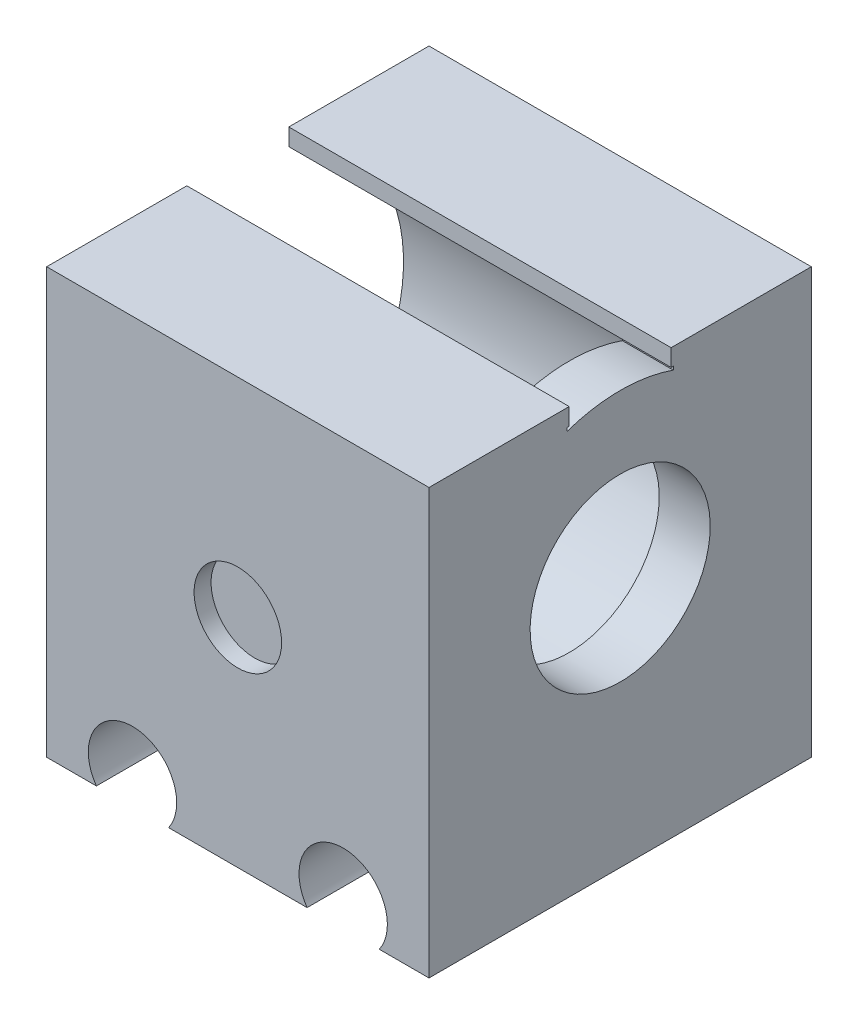
ISO-10303-21;
HEADER;
FILE_DESCRIPTION(('STEP AP214'),'2;1');
FILE_NAME('part.step','',(''),(''),'','','');
FILE_SCHEMA(('AUTOMOTIVE_DESIGN { 1 0 10303 214 1 1 1 1 }'));
ENDSEC;
DATA;
#1=APPLICATION_CONTEXT('core data for automotive mechanical design processes');
#2=APPLICATION_PROTOCOL_DEFINITION('international standard','automotive_design',2000,#1);
#3=PRODUCT_CONTEXT('',#1,'mechanical');
#4=PRODUCT('Part','Part','',(#3));
#5=PRODUCT_RELATED_PRODUCT_CATEGORY('part','',(#4));
#6=PRODUCT_DEFINITION_FORMATION('','',#4);
#7=PRODUCT_DEFINITION_CONTEXT('part definition',#1,'design');
#8=PRODUCT_DEFINITION('design','',#6,#7);
#9=PRODUCT_DEFINITION_SHAPE('','',#8);
#10=(LENGTH_UNIT() NAMED_UNIT(*) SI_UNIT(.MILLI.,.METRE.));
#11=(NAMED_UNIT(*) PLANE_ANGLE_UNIT() SI_UNIT($,.RADIAN.));
#12=(NAMED_UNIT(*) SI_UNIT($,.STERADIAN.) SOLID_ANGLE_UNIT());
#13=UNCERTAINTY_MEASURE_WITH_UNIT(LENGTH_MEASURE(1.E-05),#10,'distance_accuracy_value','');
#14=(GEOMETRIC_REPRESENTATION_CONTEXT(3) GLOBAL_UNCERTAINTY_ASSIGNED_CONTEXT((#13)) GLOBAL_UNIT_ASSIGNED_CONTEXT((#10,
#11,#12)) REPRESENTATION_CONTEXT('',''));
#15=CARTESIAN_POINT('',(0.,0.,0.));
#16=DIRECTION('',(0.,0.,1.));
#17=DIRECTION('',(1.,0.,0.));
#18=AXIS2_PLACEMENT_3D('',#15,#16,#17);
#19=CARTESIAN_POINT('',(-14.2633928571429,22.0982142857143,45.));
#20=DIRECTION('',(0.,-1.,0.));
#21=DIRECTION('',(0.,0.,-1.));
#22=AXIS2_PLACEMENT_3D('',#19,#20,#21);
#23=PLANE('',#22);
#24=DIRECTION('',(0.,0.,-1.));
#25=VECTOR('',#24,1.);
#26=CARTESIAN_POINT('',(30.7366071428571,22.0982142857143,45.));
#27=LINE('',#26,#25);
#28=CARTESIAN_POINT('',(30.7366071428571,22.0982142857143,45.));
#29=VERTEX_POINT('',#28);
#30=CARTESIAN_POINT('',(30.7366071428572,22.0982142857143,28.5));
#31=VERTEX_POINT('',#30);
#32=EDGE_CURVE('E287',#29,#31,#27,.T.);
#33=ORIENTED_EDGE('',*,*,#32,.T.);
#34=DIRECTION('',(-1.,0.,0.));
#35=VECTOR('',#34,1.);
#36=CARTESIAN_POINT('',(30.7366071428572,22.0982142857143,28.5));
#37=LINE('',#36,#35);
#38=CARTESIAN_POINT('',(-14.2633928571429,22.0982142857143,28.5));
#39=VERTEX_POINT('',#38);
#40=EDGE_CURVE('E176',#31,#39,#37,.T.);
#41=ORIENTED_EDGE('',*,*,#40,.T.);
#42=DIRECTION('',(0.,0.,-1.));
#43=VECTOR('',#42,1.);
#44=CARTESIAN_POINT('',(-14.2633928571429,22.0982142857143,45.));
#45=LINE('',#44,#43);
#46=CARTESIAN_POINT('',(-14.2633928571429,22.0982142857143,45.));
#47=VERTEX_POINT('',#46);
#48=EDGE_CURVE('E189',#47,#39,#45,.T.);
#49=ORIENTED_EDGE('',*,*,#48,.F.);
#50=DIRECTION('',(-1.,0.,0.));
#51=VECTOR('',#50,1.);
#52=CARTESIAN_POINT('',(-14.2633928571429,22.0982142857143,45.));
#53=LINE('',#52,#51);
#54=EDGE_CURVE('E270',#29,#47,#53,.T.);
#55=ORIENTED_EDGE('',*,*,#54,.F.);
#56=EDGE_LOOP('',(#33,#41,#49,#55));
#57=FACE_BOUND('',#56,.T.);
#58=ADVANCED_FACE('F44',(#57),#23,.F.);
#59=CARTESIAN_POINT('',(-14.2633928571429,-27.9017857142857,45.));
#60=DIRECTION('',(0.,1.,0.));
#61=DIRECTION('',(0.,0.,1.));
#62=AXIS2_PLACEMENT_3D('',#59,#60,#61);
#63=PLANE('',#62);
#64=DIRECTION('',(1.,0.,0.));
#65=VECTOR('',#64,1.);
#66=CARTESIAN_POINT('',(-14.2633928571429,-27.9017857142857,0.));
#67=LINE('',#66,#65);
#68=CARTESIAN_POINT('',(-14.2633928571429,-27.9017857142857,0.));
#69=VERTEX_POINT('',#68);
#70=CARTESIAN_POINT('',(-8.41074497346191,-27.9017857142857,0.));
#71=VERTEX_POINT('',#70);
#72=EDGE_CURVE('E276',#69,#71,#67,.T.);
#73=ORIENTED_EDGE('',*,*,#72,.T.);
#74=DIRECTION('',(0.,0.,1.));
#75=VECTOR('',#74,1.);
#76=CARTESIAN_POINT('',(-8.41074497346191,-27.9017857142857,0.));
#77=LINE('',#76,#75);
#78=CARTESIAN_POINT('',(-8.41074497346191,-27.9017857142857,45.));
#79=VERTEX_POINT('',#78);
#80=EDGE_CURVE('E255',#71,#79,#77,.T.);
#81=ORIENTED_EDGE('',*,*,#80,.T.);
#82=DIRECTION('',(1.,0.,0.));
#83=VECTOR('',#82,1.);
#84=CARTESIAN_POINT('',(-14.2633928571429,-27.9017857142857,45.));
#85=LINE('',#84,#83);
#86=CARTESIAN_POINT('',(-14.2633928571429,-27.9017857142857,45.));
#87=VERTEX_POINT('',#86);
#88=EDGE_CURVE('E264',#87,#79,#85,.T.);
#89=ORIENTED_EDGE('',*,*,#88,.F.);
#90=DIRECTION('',(0.,0.,-1.));
#91=VECTOR('',#90,1.);
#92=CARTESIAN_POINT('',(-14.2633928571429,-27.9017857142857,45.));
#93=LINE('',#92,#91);
#94=EDGE_CURVE('E292',#87,#69,#93,.T.);
#95=ORIENTED_EDGE('',*,*,#94,.T.);
#96=EDGE_LOOP('',(#73,#81,#89,#95));
#97=FACE_BOUND('',#96,.T.);
#98=ADVANCED_FACE('F382',(#97),#63,.F.);
#99=CARTESIAN_POINT('',(0.0839592591762011,-27.9017857142857,45.));
#100=VERTEX_POINT('',#99);
#101=CARTESIAN_POINT('',(16.3892550265381,-27.9017857142857,45.));
#102=VERTEX_POINT('',#101);
#103=EDGE_CURVE('E268',#100,#102,#85,.T.);
#104=ORIENTED_EDGE('',*,*,#103,.F.);
#105=DIRECTION('',(0.,0.,1.));
#106=VECTOR('',#105,1.);
#107=CARTESIAN_POINT('',(0.0839592591762002,-27.9017857142857,0.));
#108=LINE('',#107,#106);
#109=CARTESIAN_POINT('',(0.0839592591762011,-27.9017857142857,0.));
#110=VERTEX_POINT('',#109);
#111=EDGE_CURVE('E252',#100,#110,#108,.F.);
#112=ORIENTED_EDGE('',*,*,#111,.T.);
#113=CARTESIAN_POINT('',(16.3892550265381,-27.9017857142857,0.));
#114=VERTEX_POINT('',#113);
#115=EDGE_CURVE('E280',#110,#114,#67,.T.);
#116=ORIENTED_EDGE('',*,*,#115,.T.);
#117=DIRECTION('',(0.,0.,1.));
#118=VECTOR('',#117,1.);
#119=CARTESIAN_POINT('',(16.3892550265381,-27.9017857142857,0.));
#120=LINE('',#119,#118);
#121=EDGE_CURVE('E249',#114,#102,#120,.T.);
#122=ORIENTED_EDGE('',*,*,#121,.T.);
#123=EDGE_LOOP('',(#104,#112,#116,#122));
#124=FACE_BOUND('',#123,.T.);
#125=ADVANCED_FACE('F390',(#124),#63,.F.);
#126=CARTESIAN_POINT('',(-14.2633928571429,22.0982142857143,45.));
#127=DIRECTION('',(1.,0.,0.));
#128=DIRECTION('',(0.,1.,0.));
#129=AXIS2_PLACEMENT_3D('',#126,#127,#128);
#130=PLANE('',#129);
#131=ORIENTED_EDGE('',*,*,#48,.T.);
#132=DIRECTION('',(0.,-1.,0.));
#133=VECTOR('',#132,1.);
#134=CARTESIAN_POINT('',(-14.2633928571429,22.0982142857143,28.5));
#135=LINE('',#134,#133);
#136=CARTESIAN_POINT('',(-14.2633928571429,20.0844199696068,28.5));
#137=VERTEX_POINT('',#136);
#138=EDGE_CURVE('E170',#39,#137,#135,.T.);
#139=ORIENTED_EDGE('',*,*,#138,.T.);
#140=DIRECTION('',(0.,0.,1.));
#141=VECTOR('',#140,1.);
#142=CARTESIAN_POINT('',(-14.2633928571429,20.0844199696068,28.5));
#143=LINE('',#142,#141);
#144=CARTESIAN_POINT('',(-14.2633928571429,20.0844199696068,28.75));
#145=VERTEX_POINT('',#144);
#146=EDGE_CURVE('E180',#137,#145,#143,.T.);
#147=ORIENTED_EDGE('',*,*,#146,.T.);
#148=CARTESIAN_POINT('',(-14.2633928571429,1.61315850754096,22.5));
#149=DIRECTION('',(-1.,0.,0.));
#150=DIRECTION('',(0.,-1.,0.));
#151=AXIS2_PLACEMENT_3D('',#148,#149,#150);
#152=CIRCLE('',#151,19.5);
#153=CARTESIAN_POINT('',(-14.2633928571429,20.0844199696068,16.25));
#154=VERTEX_POINT('',#153);
#155=EDGE_CURVE('E211',#154,#145,#152,.T.);
#156=ORIENTED_EDGE('',*,*,#155,.F.);
#157=DIRECTION('',(0.,0.,1.));
#158=VECTOR('',#157,1.);
#159=CARTESIAN_POINT('',(-14.2633928571429,20.0844199696068,16.25));
#160=LINE('',#159,#158);
#161=CARTESIAN_POINT('',(-14.2633928571429,20.0844199696068,16.5));
#162=VERTEX_POINT('',#161);
#163=EDGE_CURVE('E201',#154,#162,#160,.T.);
#164=ORIENTED_EDGE('',*,*,#163,.T.);
#165=DIRECTION('',(0.,1.,0.));
#166=VECTOR('',#165,1.);
#167=CARTESIAN_POINT('',(-14.2633928571429,20.0844199696068,16.5));
#168=LINE('',#167,#166);
#169=CARTESIAN_POINT('',(-14.2633928571429,22.0982142857143,16.5));
#170=VERTEX_POINT('',#169);
#171=EDGE_CURVE('E185',#162,#170,#168,.T.);
#172=ORIENTED_EDGE('',*,*,#171,.T.);
#173=CARTESIAN_POINT('',(-14.2633928571429,22.0982142857143,0.));
#174=VERTEX_POINT('',#173);
#175=EDGE_CURVE('E272',#170,#174,#45,.T.);
#176=ORIENTED_EDGE('',*,*,#175,.T.);
#177=DIRECTION('',(0.,-1.,0.));
#178=VECTOR('',#177,1.);
#179=CARTESIAN_POINT('',(-14.2633928571429,22.0982142857143,0.));
#180=LINE('',#179,#178);
#181=EDGE_CURVE('E258',#174,#69,#180,.T.);
#182=ORIENTED_EDGE('',*,*,#181,.T.);
#183=ORIENTED_EDGE('',*,*,#94,.F.);
#184=DIRECTION('',(0.,-1.,0.));
#185=VECTOR('',#184,1.);
#186=CARTESIAN_POINT('',(-14.2633928571429,22.0982142857143,45.));
#187=LINE('',#186,#185);
#188=EDGE_CURVE('E259',#47,#87,#187,.T.);
#189=ORIENTED_EDGE('',*,*,#188,.F.);
#190=EDGE_LOOP('',(#131,#139,#147,#156,#164,#172,#176,#182,#183,#189));
#191=FACE_BOUND('',#190,.T.);
#192=ADVANCED_FACE('F46',(#191),#130,.F.);
#193=CARTESIAN_POINT('',(24.8839592591762,-27.9017857142857,45.));
#194=VERTEX_POINT('',#193);
#195=CARTESIAN_POINT('',(30.7366071428571,-27.9017857142857,45.));
#196=VERTEX_POINT('',#195);
#197=EDGE_CURVE('E262',#194,#196,#85,.T.);
#198=ORIENTED_EDGE('',*,*,#197,.F.);
#199=DIRECTION('',(0.,0.,1.));
#200=VECTOR('',#199,1.);
#201=CARTESIAN_POINT('',(24.8839592591762,-27.9017857142857,0.));
#202=LINE('',#201,#200);
#203=CARTESIAN_POINT('',(24.8839592591762,-27.9017857142857,0.));
#204=VERTEX_POINT('',#203);
#205=EDGE_CURVE('E245',#194,#204,#202,.F.);
#206=ORIENTED_EDGE('',*,*,#205,.T.);
#207=CARTESIAN_POINT('',(30.7366071428571,-27.9017857142857,0.));
#208=VERTEX_POINT('',#207);
#209=EDGE_CURVE('E275',#204,#208,#67,.T.);
#210=ORIENTED_EDGE('',*,*,#209,.T.);
#211=DIRECTION('',(0.,0.,-1.));
#212=VECTOR('',#211,1.);
#213=CARTESIAN_POINT('',(30.7366071428571,-27.9017857142857,45.));
#214=LINE('',#213,#212);
#215=EDGE_CURVE('E289',#196,#208,#214,.T.);
#216=ORIENTED_EDGE('',*,*,#215,.F.);
#217=EDGE_LOOP('',(#198,#206,#210,#216));
#218=FACE_BOUND('',#217,.T.);
#219=ADVANCED_FACE('F357',(#218),#63,.F.);
#220=CARTESIAN_POINT('',(30.7366071428571,22.0982142857143,45.));
#221=DIRECTION('',(-1.,0.,0.));
#222=DIRECTION('',(0.,-1.,0.));
#223=AXIS2_PLACEMENT_3D('',#220,#221,#222);
#224=PLANE('',#223);
#225=CARTESIAN_POINT('',(30.7366071428571,1.61315850754097,22.5));
#226=DIRECTION('',(1.,0.,0.));
#227=DIRECTION('',(0.,1.,0.));
#228=AXIS2_PLACEMENT_3D('',#225,#226,#227);
#229=CIRCLE('',#228,10.6);
#230=CARTESIAN_POINT('',(30.7366071428571,12.213158507541,22.5));
#231=VERTEX_POINT('',#230);
#232=EDGE_CURVE('E227',#231,#231,#229,.T.);
#233=ORIENTED_EDGE('',*,*,#232,.F.);
#234=EDGE_LOOP('',(#233));
#235=FACE_BOUND('',#234,.T.);
#236=DIRECTION('',(0.,1.,0.));
#237=VECTOR('',#236,1.);
#238=CARTESIAN_POINT('',(30.7366071428571,23.3717218515337,16.25));
#239=LINE('',#238,#237);
#240=CARTESIAN_POINT('',(30.7366071428571,19.6880893511155,16.25));
#241=VERTEX_POINT('',#240);
#242=CARTESIAN_POINT('',(30.7366071428571,20.0844199696068,16.25));
#243=VERTEX_POINT('',#242);
#244=EDGE_CURVE('E67',#241,#243,#239,.T.);
#245=ORIENTED_EDGE('',*,*,#244,.F.);
#246=CARTESIAN_POINT('',(30.7366071428571,1.61315850754097,22.5));
#247=DIRECTION('',(1.,0.,0.));
#248=DIRECTION('',(0.,1.,0.));
#249=AXIS2_PLACEMENT_3D('',#246,#247,#248);
#250=CIRCLE('',#249,19.125);
#251=CARTESIAN_POINT('',(30.7366071428571,19.6880893511155,28.75));
#252=VERTEX_POINT('',#251);
#253=EDGE_CURVE('E231',#241,#252,#250,.T.);
#254=ORIENTED_EDGE('',*,*,#253,.T.);
#255=DIRECTION('',(0.,-1.,0.));
#256=VECTOR('',#255,1.);
#257=CARTESIAN_POINT('',(30.7366071428571,23.3717218515337,28.75));
#258=LINE('',#257,#256);
#259=CARTESIAN_POINT('',(30.7366071428571,20.0844199696068,28.75));
#260=VERTEX_POINT('',#259);
#261=EDGE_CURVE('E237',#260,#252,#258,.T.);
#262=ORIENTED_EDGE('',*,*,#261,.F.);
#263=DIRECTION('',(0.,0.,1.));
#264=VECTOR('',#263,1.);
#265=CARTESIAN_POINT('',(30.7366071428572,20.0844199696068,28.5));
#266=LINE('',#265,#264);
#267=CARTESIAN_POINT('',(30.7366071428572,20.0844199696068,28.5));
#268=VERTEX_POINT('',#267);
#269=EDGE_CURVE('E191',#268,#260,#266,.T.);
#270=ORIENTED_EDGE('',*,*,#269,.F.);
#271=DIRECTION('',(0.,-1.,0.));
#272=VECTOR('',#271,1.);
#273=CARTESIAN_POINT('',(30.7366071428572,22.0982142857143,28.5));
#274=LINE('',#273,#272);
#275=EDGE_CURVE('E172',#31,#268,#274,.T.);
#276=ORIENTED_EDGE('',*,*,#275,.F.);
#277=ORIENTED_EDGE('',*,*,#32,.F.);
#278=DIRECTION('',(0.,1.,0.));
#279=VECTOR('',#278,1.);
#280=CARTESIAN_POINT('',(30.7366071428571,22.0982142857143,45.));
#281=LINE('',#280,#279);
#282=EDGE_CURVE('E267',#196,#29,#281,.T.);
#283=ORIENTED_EDGE('',*,*,#282,.F.);
#284=ORIENTED_EDGE('',*,*,#215,.T.);
#285=DIRECTION('',(0.,1.,0.));
#286=VECTOR('',#285,1.);
#287=CARTESIAN_POINT('',(30.7366071428571,22.0982142857143,0.));
#288=LINE('',#287,#286);
#289=CARTESIAN_POINT('',(30.7366071428571,22.0982142857143,0.));
#290=VERTEX_POINT('',#289);
#291=EDGE_CURVE('E279',#208,#290,#288,.T.);
#292=ORIENTED_EDGE('',*,*,#291,.T.);
#293=CARTESIAN_POINT('',(30.7366071428572,22.0982142857143,16.5));
#294=VERTEX_POINT('',#293);
#295=EDGE_CURVE('E286',#294,#290,#27,.T.);
#296=ORIENTED_EDGE('',*,*,#295,.F.);
#297=DIRECTION('',(0.,1.,0.));
#298=VECTOR('',#297,1.);
#299=CARTESIAN_POINT('',(30.7366071428572,20.0844199696068,16.5));
#300=LINE('',#299,#298);
#301=CARTESIAN_POINT('',(30.7366071428572,20.0844199696068,16.5));
#302=VERTEX_POINT('',#301);
#303=EDGE_CURVE('E197',#302,#294,#300,.T.);
#304=ORIENTED_EDGE('',*,*,#303,.F.);
#305=DIRECTION('',(0.,0.,1.));
#306=VECTOR('',#305,1.);
#307=CARTESIAN_POINT('',(30.7366071428572,20.0844199696068,16.25));
#308=LINE('',#307,#306);
#309=EDGE_CURVE('E200',#243,#302,#308,.T.);
#310=ORIENTED_EDGE('',*,*,#309,.F.);
#311=EDGE_LOOP('',(#245,#254,#262,#270,#276,#277,#283,#284,#292,#296,#304,#310));
#312=FACE_BOUND('',#311,.T.);
#313=ADVANCED_FACE('F310',(#235,#312),#224,.F.);
#314=ORIENTED_EDGE('',*,*,#175,.F.);
#315=DIRECTION('',(-1.,0.,0.));
#316=VECTOR('',#315,1.);
#317=CARTESIAN_POINT('',(30.7366071428572,22.0982142857143,16.5));
#318=LINE('',#317,#316);
#319=EDGE_CURVE('E204',#294,#170,#318,.T.);
#320=ORIENTED_EDGE('',*,*,#319,.F.);
#321=ORIENTED_EDGE('',*,*,#295,.T.);
#322=DIRECTION('',(-1.,0.,0.));
#323=VECTOR('',#322,1.);
#324=CARTESIAN_POINT('',(-14.2633928571429,22.0982142857143,0.));
#325=LINE('',#324,#323);
#326=EDGE_CURVE('E263',#290,#174,#325,.T.);
#327=ORIENTED_EDGE('',*,*,#326,.T.);
#328=EDGE_LOOP('',(#314,#320,#321,#327));
#329=FACE_BOUND('',#328,.T.);
#330=ADVANCED_FACE('F364',(#329),#23,.F.);
#331=CARTESIAN_POINT('',(0.,0.,45.));
#332=DIRECTION('',(0.,0.,1.));
#333=DIRECTION('',(1.,0.,0.));
#334=AXIS2_PLACEMENT_3D('',#331,#332,#333);
#335=PLANE('',#334);
#336=CARTESIAN_POINT('',(8.23660714285715,-2.40178571428571,45.));
#337=DIRECTION('',(0.,0.,1.));
#338=DIRECTION('',(1.,0.,0.));
#339=AXIS2_PLACEMENT_3D('',#336,#337,#338);
#340=CIRCLE('',#339,5.15);
#341=CARTESIAN_POINT('',(13.3866071428572,-2.40178571428571,45.));
#342=VERTEX_POINT('',#341);
#343=EDGE_CURVE('E323',#342,#342,#340,.T.);
#344=ORIENTED_EDGE('',*,*,#343,.F.);
#345=EDGE_LOOP('',(#344));
#346=FACE_BOUND('',#345,.T.);
#347=CARTESIAN_POINT('',(-4.16339285714286,-24.9017857142857,45.));
#348=DIRECTION('',(0.,0.,1.));
#349=DIRECTION('',(1.,0.,0.));
#350=AXIS2_PLACEMENT_3D('',#347,#348,#349);
#351=CIRCLE('',#350,5.2);
#352=EDGE_CURVE('E243',#100,#79,#351,.T.);
#353=ORIENTED_EDGE('',*,*,#352,.F.);
#354=ORIENTED_EDGE('',*,*,#103,.T.);
#355=CARTESIAN_POINT('',(20.6366071428571,-24.9017857142857,45.));
#356=DIRECTION('',(0.,0.,1.));
#357=DIRECTION('',(1.,0.,0.));
#358=AXIS2_PLACEMENT_3D('',#355,#356,#357);
#359=CIRCLE('',#358,5.2);
#360=EDGE_CURVE('E242',#194,#102,#359,.T.);
#361=ORIENTED_EDGE('',*,*,#360,.F.);
#362=ORIENTED_EDGE('',*,*,#197,.T.);
#363=ORIENTED_EDGE('',*,*,#282,.T.);
#364=ORIENTED_EDGE('',*,*,#54,.T.);
#365=ORIENTED_EDGE('',*,*,#188,.T.);
#366=ORIENTED_EDGE('',*,*,#88,.T.);
#367=EDGE_LOOP('',(#353,#354,#361,#362,#363,#364,#365,#366));
#368=FACE_BOUND('',#367,.T.);
#369=ADVANCED_FACE('F348',(#346,#368),#335,.T.);
#370=CARTESIAN_POINT('',(0.,0.,0.));
#371=DIRECTION('',(0.,0.,1.));
#372=DIRECTION('',(1.,0.,0.));
#373=AXIS2_PLACEMENT_3D('',#370,#371,#372);
#374=PLANE('',#373);
#375=CARTESIAN_POINT('',(8.23660714285714,-2.40178571428571,0.));
#376=DIRECTION('',(0.,0.,-1.));
#377=DIRECTION('',(-1.,0.,0.));
#378=AXIS2_PLACEMENT_3D('',#375,#376,#377);
#379=CIRCLE('',#378,5.15);
#380=CARTESIAN_POINT('',(3.08660714285714,-2.40178571428571,0.));
#381=VERTEX_POINT('',#380);
#382=EDGE_CURVE('E329',#381,#381,#379,.T.);
#383=ORIENTED_EDGE('',*,*,#382,.F.);
#384=EDGE_LOOP('',(#383));
#385=FACE_BOUND('',#384,.T.);
#386=ORIENTED_EDGE('',*,*,#115,.F.);
#387=CARTESIAN_POINT('',(-4.16339285714286,-24.9017857142857,0.));
#388=DIRECTION('',(0.,0.,1.));
#389=DIRECTION('',(1.,0.,0.));
#390=AXIS2_PLACEMENT_3D('',#387,#388,#389);
#391=CIRCLE('',#390,5.2);
#392=EDGE_CURVE('E298',#110,#71,#391,.T.);
#393=ORIENTED_EDGE('',*,*,#392,.T.);
#394=ORIENTED_EDGE('',*,*,#72,.F.);
#395=ORIENTED_EDGE('',*,*,#181,.F.);
#396=ORIENTED_EDGE('',*,*,#326,.F.);
#397=ORIENTED_EDGE('',*,*,#291,.F.);
#398=ORIENTED_EDGE('',*,*,#209,.F.);
#399=CARTESIAN_POINT('',(20.6366071428571,-24.9017857142857,0.));
#400=DIRECTION('',(0.,0.,1.));
#401=DIRECTION('',(1.,0.,0.));
#402=AXIS2_PLACEMENT_3D('',#399,#400,#401);
#403=CIRCLE('',#402,5.2);
#404=EDGE_CURVE('E295',#204,#114,#403,.T.);
#405=ORIENTED_EDGE('',*,*,#404,.T.);
#406=EDGE_LOOP('',(#386,#393,#394,#395,#396,#397,#398,#405));
#407=FACE_BOUND('',#406,.T.);
#408=ADVANCED_FACE('F344',(#385,#407),#374,.F.);
#409=CARTESIAN_POINT('',(20.6366071428571,-24.9017857142857,0.));
#410=DIRECTION('',(0.,0.,1.));
#411=DIRECTION('',(1.,0.,0.));
#412=AXIS2_PLACEMENT_3D('',#409,#410,#411);
#413=CYLINDRICAL_SURFACE('',#412,5.2);
#414=ORIENTED_EDGE('',*,*,#404,.F.);
#415=ORIENTED_EDGE('',*,*,#205,.F.);
#416=ORIENTED_EDGE('',*,*,#360,.T.);
#417=ORIENTED_EDGE('',*,*,#121,.F.);
#418=EDGE_LOOP('',(#414,#415,#416,#417));
#419=FACE_BOUND('',#418,.T.);
#420=ADVANCED_FACE('F347',(#419),#413,.F.);
#421=CARTESIAN_POINT('',(-4.16339285714286,-24.9017857142857,0.));
#422=DIRECTION('',(0.,0.,1.));
#423=DIRECTION('',(1.,0.,0.));
#424=AXIS2_PLACEMENT_3D('',#421,#422,#423);
#425=CYLINDRICAL_SURFACE('',#424,5.2);
#426=ORIENTED_EDGE('',*,*,#392,.F.);
#427=ORIENTED_EDGE('',*,*,#111,.F.);
#428=ORIENTED_EDGE('',*,*,#352,.T.);
#429=ORIENTED_EDGE('',*,*,#80,.F.);
#430=EDGE_LOOP('',(#426,#427,#428,#429));
#431=FACE_BOUND('',#430,.T.);
#432=ADVANCED_FACE('F419',(#431),#425,.F.);
#433=CARTESIAN_POINT('',(-14.2633928571429,23.3717218515337,16.25));
#434=DIRECTION('',(0.,0.,-1.));
#435=DIRECTION('',(0.,1.,0.));
#436=AXIS2_PLACEMENT_3D('',#433,#434,#435);
#437=PLANE('',#436);
#438=ORIENTED_EDGE('',*,*,#244,.T.);
#439=DIRECTION('',(-1.,0.,0.));
#440=VECTOR('',#439,1.);
#441=CARTESIAN_POINT('',(30.7366071428572,20.0844199696068,16.25));
#442=LINE('',#441,#440);
#443=CARTESIAN_POINT('',(24.7366071428572,20.0844199696068,16.25));
#444=VERTEX_POINT('',#443);
#445=EDGE_CURVE('E212',#243,#444,#442,.T.);
#446=ORIENTED_EDGE('',*,*,#445,.T.);
#447=DIRECTION('',(0.,1.,0.));
#448=VECTOR('',#447,1.);
#449=CARTESIAN_POINT('',(24.7366071428572,23.3717218515337,16.25));
#450=LINE('',#449,#448);
#451=CARTESIAN_POINT('',(24.7366071428572,19.6880893511155,16.25));
#452=VERTEX_POINT('',#451);
#453=EDGE_CURVE('E221',#452,#444,#450,.T.);
#454=ORIENTED_EDGE('',*,*,#453,.F.);
#455=DIRECTION('',(1.,0.,0.));
#456=VECTOR('',#455,1.);
#457=CARTESIAN_POINT('',(-14.2633928571429,19.6880893511155,16.25));
#458=LINE('',#457,#456);
#459=EDGE_CURVE('E301',#241,#452,#458,.F.);
#460=ORIENTED_EDGE('',*,*,#459,.F.);
#461=EDGE_LOOP('',(#438,#446,#454,#460));
#462=FACE_BOUND('',#461,.T.);
#463=ADVANCED_FACE('F317',(#462),#437,.F.);
#464=CARTESIAN_POINT('',(-14.2633928571429,23.3717218515337,28.75));
#465=DIRECTION('',(0.,0.,1.));
#466=DIRECTION('',(0.,-1.,0.));
#467=AXIS2_PLACEMENT_3D('',#464,#465,#466);
#468=PLANE('',#467);
#469=DIRECTION('',(0.,-1.,0.));
#470=VECTOR('',#469,1.);
#471=CARTESIAN_POINT('',(24.7366071428572,23.3717218515337,28.75));
#472=LINE('',#471,#470);
#473=CARTESIAN_POINT('',(24.7366071428572,20.0844199696068,28.75));
#474=VERTEX_POINT('',#473);
#475=CARTESIAN_POINT('',(24.7366071428572,19.6880893511155,28.75));
#476=VERTEX_POINT('',#475);
#477=EDGE_CURVE('E218',#474,#476,#472,.T.);
#478=ORIENTED_EDGE('',*,*,#477,.F.);
#479=DIRECTION('',(-1.,0.,0.));
#480=VECTOR('',#479,1.);
#481=CARTESIAN_POINT('',(30.7366071428572,20.0844199696068,28.75));
#482=LINE('',#481,#480);
#483=EDGE_CURVE('E59',#260,#474,#482,.T.);
#484=ORIENTED_EDGE('',*,*,#483,.F.);
#485=ORIENTED_EDGE('',*,*,#261,.T.);
#486=DIRECTION('',(1.,0.,0.));
#487=VECTOR('',#486,1.);
#488=CARTESIAN_POINT('',(-14.2633928571429,19.6880893511155,28.75));
#489=LINE('',#488,#487);
#490=EDGE_CURVE('E52',#476,#252,#489,.T.);
#491=ORIENTED_EDGE('',*,*,#490,.F.);
#492=EDGE_LOOP('',(#478,#484,#485,#491));
#493=FACE_BOUND('',#492,.T.);
#494=ADVANCED_FACE('F320',(#493),#468,.F.);
#495=CARTESIAN_POINT('',(24.7366071428571,1.61315850754097,22.5));
#496=DIRECTION('',(1.,0.,0.));
#497=DIRECTION('',(0.,1.,0.));
#498=AXIS2_PLACEMENT_3D('',#495,#496,#497);
#499=CYLINDRICAL_SURFACE('',#498,19.125);
#500=ORIENTED_EDGE('',*,*,#459,.T.);
#501=CARTESIAN_POINT('',(24.7366071428571,1.61315850754097,22.5));
#502=DIRECTION('',(1.,0.,0.));
#503=DIRECTION('',(0.,1.,0.));
#504=AXIS2_PLACEMENT_3D('',#501,#502,#503);
#505=CIRCLE('',#504,19.125);
#506=EDGE_CURVE('E234',#452,#476,#505,.T.);
#507=ORIENTED_EDGE('',*,*,#506,.T.);
#508=ORIENTED_EDGE('',*,*,#490,.T.);
#509=ORIENTED_EDGE('',*,*,#253,.F.);
#510=EDGE_LOOP('',(#500,#507,#508,#509));
#511=FACE_BOUND('',#510,.T.);
#512=ADVANCED_FACE('F307',(#511),#499,.T.);
#513=CARTESIAN_POINT('',(24.7366071428571,1.61315850754097,22.5));
#514=DIRECTION('',(1.,0.,0.));
#515=DIRECTION('',(0.,1.,0.));
#516=AXIS2_PLACEMENT_3D('',#513,#514,#515);
#517=PLANE('',#516);
#518=CARTESIAN_POINT('',(24.7366071428571,1.61315850754097,22.5));
#519=DIRECTION('',(1.,0.,0.));
#520=DIRECTION('',(0.,1.,0.));
#521=AXIS2_PLACEMENT_3D('',#518,#519,#520);
#522=CIRCLE('',#521,10.6);
#523=CARTESIAN_POINT('',(24.7366071428571,12.213158507541,22.5));
#524=VERTEX_POINT('',#523);
#525=EDGE_CURVE('E228',#524,#524,#522,.T.);
#526=ORIENTED_EDGE('',*,*,#525,.T.);
#527=EDGE_LOOP('',(#526));
#528=FACE_BOUND('',#527,.T.);
#529=ORIENTED_EDGE('',*,*,#506,.F.);
#530=ORIENTED_EDGE('',*,*,#453,.T.);
#531=CARTESIAN_POINT('',(24.7366071428572,1.61315850754097,22.5));
#532=DIRECTION('',(-1.,0.,0.));
#533=DIRECTION('',(0.,-1.,0.));
#534=AXIS2_PLACEMENT_3D('',#531,#532,#533);
#535=CIRCLE('',#534,19.5);
#536=EDGE_CURVE('E216',#444,#474,#535,.T.);
#537=ORIENTED_EDGE('',*,*,#536,.T.);
#538=ORIENTED_EDGE('',*,*,#477,.T.);
#539=EDGE_LOOP('',(#529,#530,#537,#538));
#540=FACE_BOUND('',#539,.T.);
#541=ADVANCED_FACE('F319',(#528,#540),#517,.F.);
#542=CARTESIAN_POINT('',(24.7366071428571,1.61315850754097,22.5));
#543=DIRECTION('',(1.,0.,0.));
#544=DIRECTION('',(0.,1.,0.));
#545=AXIS2_PLACEMENT_3D('',#542,#543,#544);
#546=CYLINDRICAL_SURFACE('',#545,10.6);
#547=ORIENTED_EDGE('',*,*,#525,.F.);
#548=EDGE_LOOP('',(#547));
#549=FACE_BOUND('',#548,.T.);
#550=ORIENTED_EDGE('',*,*,#232,.T.);
#551=EDGE_LOOP('',(#550));
#552=FACE_BOUND('',#551,.T.);
#553=ADVANCED_FACE('F371',(#549,#552),#546,.F.);
#554=CARTESIAN_POINT('',(24.7366071428572,1.61315850754097,22.5));
#555=DIRECTION('',(-1.,0.,0.));
#556=DIRECTION('',(0.,-1.,0.));
#557=AXIS2_PLACEMENT_3D('',#554,#555,#556);
#558=CYLINDRICAL_SURFACE('',#557,19.5);
#559=ORIENTED_EDGE('',*,*,#155,.T.);
#560=DIRECTION('',(-1.,0.,0.));
#561=VECTOR('',#560,1.);
#562=CARTESIAN_POINT('',(24.7366071428572,20.0844199696068,28.75));
#563=LINE('',#562,#561);
#564=EDGE_CURVE('E11',#474,#145,#563,.T.);
#565=ORIENTED_EDGE('',*,*,#564,.F.);
#566=ORIENTED_EDGE('',*,*,#536,.F.);
#567=DIRECTION('',(-1.,0.,0.));
#568=VECTOR('',#567,1.);
#569=CARTESIAN_POINT('',(24.7366071428572,20.0844199696068,16.25));
#570=LINE('',#569,#568);
#571=EDGE_CURVE('E224',#154,#444,#570,.F.);
#572=ORIENTED_EDGE('',*,*,#571,.F.);
#573=EDGE_LOOP('',(#559,#565,#566,#572));
#574=FACE_BOUND('',#573,.T.);
#575=ADVANCED_FACE('F369',(#574),#558,.F.);
#576=CARTESIAN_POINT('',(30.7366071428572,20.0844199696068,16.5));
#577=DIRECTION('',(0.,0.,1.));
#578=DIRECTION('',(1.,0.,0.));
#579=AXIS2_PLACEMENT_3D('',#576,#577,#578);
#580=PLANE('',#579);
#581=ORIENTED_EDGE('',*,*,#171,.F.);
#582=DIRECTION('',(-1.,0.,0.));
#583=VECTOR('',#582,1.);
#584=CARTESIAN_POINT('',(30.7366071428572,20.0844199696068,16.5));
#585=LINE('',#584,#583);
#586=EDGE_CURVE('E209',#302,#162,#585,.T.);
#587=ORIENTED_EDGE('',*,*,#586,.F.);
#588=ORIENTED_EDGE('',*,*,#303,.T.);
#589=ORIENTED_EDGE('',*,*,#319,.T.);
#590=EDGE_LOOP('',(#581,#587,#588,#589));
#591=FACE_BOUND('',#590,.T.);
#592=ADVANCED_FACE('F367',(#591),#580,.T.);
#593=CARTESIAN_POINT('',(30.7366071428572,20.0844199696068,16.25));
#594=DIRECTION('',(0.,-1.,0.));
#595=DIRECTION('',(0.,0.,-1.));
#596=AXIS2_PLACEMENT_3D('',#593,#594,#595);
#597=PLANE('',#596);
#598=ORIENTED_EDGE('',*,*,#163,.F.);
#599=ORIENTED_EDGE('',*,*,#571,.T.);
#600=ORIENTED_EDGE('',*,*,#445,.F.);
#601=ORIENTED_EDGE('',*,*,#309,.T.);
#602=ORIENTED_EDGE('',*,*,#586,.T.);
#603=EDGE_LOOP('',(#598,#599,#600,#601,#602));
#604=FACE_BOUND('',#603,.T.);
#605=ADVANCED_FACE('F315',(#604),#597,.T.);
#606=CARTESIAN_POINT('',(30.7366071428572,20.0844199696068,28.5));
#607=DIRECTION('',(0.,-1.,0.));
#608=DIRECTION('',(1.,0.,0.));
#609=AXIS2_PLACEMENT_3D('',#606,#607,#608);
#610=PLANE('',#609);
#611=ORIENTED_EDGE('',*,*,#146,.F.);
#612=DIRECTION('',(-1.,0.,0.));
#613=VECTOR('',#612,1.);
#614=CARTESIAN_POINT('',(30.7366071428572,20.0844199696068,28.5));
#615=LINE('',#614,#613);
#616=EDGE_CURVE('E165',#268,#137,#615,.T.);
#617=ORIENTED_EDGE('',*,*,#616,.F.);
#618=ORIENTED_EDGE('',*,*,#269,.T.);
#619=ORIENTED_EDGE('',*,*,#483,.T.);
#620=ORIENTED_EDGE('',*,*,#564,.T.);
#621=EDGE_LOOP('',(#611,#617,#618,#619,#620));
#622=FACE_BOUND('',#621,.T.);
#623=ADVANCED_FACE('F181',(#622),#610,.T.);
#624=CARTESIAN_POINT('',(30.7366071428572,22.0982142857143,28.5));
#625=DIRECTION('',(0.,0.,-1.));
#626=DIRECTION('',(-1.,0.,0.));
#627=AXIS2_PLACEMENT_3D('',#624,#625,#626);
#628=PLANE('',#627);
#629=ORIENTED_EDGE('',*,*,#138,.F.);
#630=ORIENTED_EDGE('',*,*,#40,.F.);
#631=ORIENTED_EDGE('',*,*,#275,.T.);
#632=ORIENTED_EDGE('',*,*,#616,.T.);
#633=EDGE_LOOP('',(#629,#630,#631,#632));
#634=FACE_BOUND('',#633,.T.);
#635=ADVANCED_FACE('F167',(#634),#628,.T.);
#636=CARTESIAN_POINT('',(8.23660714285715,-2.40178571428571,43.));
#637=DIRECTION('',(0.,0.,1.));
#638=DIRECTION('',(1.,0.,0.));
#639=AXIS2_PLACEMENT_3D('',#636,#637,#638);
#640=CYLINDRICAL_SURFACE('',#639,5.15);
#641=CARTESIAN_POINT('',(8.23660714285715,-2.40178571428571,43.));
#642=DIRECTION('',(0.,0.,1.));
#643=DIRECTION('',(1.,0.,0.));
#644=AXIS2_PLACEMENT_3D('',#641,#642,#643);
#645=CIRCLE('',#644,5.15);
#646=CARTESIAN_POINT('',(13.3866071428572,-2.40178571428571,43.));
#647=VERTEX_POINT('',#646);
#648=EDGE_CURVE('E177',#647,#647,#645,.T.);
#649=ORIENTED_EDGE('',*,*,#648,.F.);
#650=EDGE_LOOP('',(#649));
#651=FACE_BOUND('',#650,.T.);
#652=ORIENTED_EDGE('',*,*,#343,.T.);
#653=EDGE_LOOP('',(#652));
#654=FACE_BOUND('',#653,.T.);
#655=ADVANCED_FACE('F554',(#651,#654),#640,.F.);
#656=CARTESIAN_POINT('',(8.23660714285715,-2.40178571428571,43.));
#657=DIRECTION('',(0.,0.,1.));
#658=DIRECTION('',(1.,0.,0.));
#659=AXIS2_PLACEMENT_3D('',#656,#657,#658);
#660=PLANE('',#659);
#661=ORIENTED_EDGE('',*,*,#648,.T.);
#662=EDGE_LOOP('',(#661));
#663=FACE_BOUND('',#662,.T.);
#664=ADVANCED_FACE('F340',(#663),#660,.T.);
#665=CARTESIAN_POINT('',(8.23660714285714,-2.40178571428571,2.));
#666=DIRECTION('',(0.,0.,-1.));
#667=DIRECTION('',(-1.,0.,0.));
#668=AXIS2_PLACEMENT_3D('',#665,#666,#667);
#669=CYLINDRICAL_SURFACE('',#668,5.15);
#670=CARTESIAN_POINT('',(8.23660714285714,-2.40178571428571,2.));
#671=DIRECTION('',(0.,0.,-1.));
#672=DIRECTION('',(-1.,0.,0.));
#673=AXIS2_PLACEMENT_3D('',#670,#671,#672);
#674=CIRCLE('',#673,5.15);
#675=CARTESIAN_POINT('',(3.08660714285714,-2.40178571428571,2.));
#676=VERTEX_POINT('',#675);
#677=EDGE_CURVE('E326',#676,#676,#674,.T.);
#678=ORIENTED_EDGE('',*,*,#677,.F.);
#679=EDGE_LOOP('',(#678));
#680=FACE_BOUND('',#679,.T.);
#681=ORIENTED_EDGE('',*,*,#382,.T.);
#682=EDGE_LOOP('',(#681));
#683=FACE_BOUND('',#682,.T.);
#684=ADVANCED_FACE('F337',(#680,#683),#669,.F.);
#685=CARTESIAN_POINT('',(8.23660714285714,-2.40178571428571,2.));
#686=DIRECTION('',(0.,0.,-1.));
#687=DIRECTION('',(-1.,0.,0.));
#688=AXIS2_PLACEMENT_3D('',#685,#686,#687);
#689=PLANE('',#688);
#690=ORIENTED_EDGE('',*,*,#677,.T.);
#691=EDGE_LOOP('',(#690));
#692=FACE_BOUND('',#691,.T.);
#693=ADVANCED_FACE('F335',(#692),#689,.T.);
#694=CLOSED_SHELL('',(#58,#98,#125,#192,#219,#313,#330,#369,#408,#420,#432,#463,#494,#512,#541,
#553,#575,#592,#605,#623,#635,#655,#664,#684,#693));
#695=MANIFOLD_SOLID_BREP('B2',#694);
#696=ADVANCED_BREP_SHAPE_REPRESENTATION('',(#18,#695),#14);
#697=SHAPE_DEFINITION_REPRESENTATION(#9,#696);
ENDSEC;
END-ISO-10303-21;
